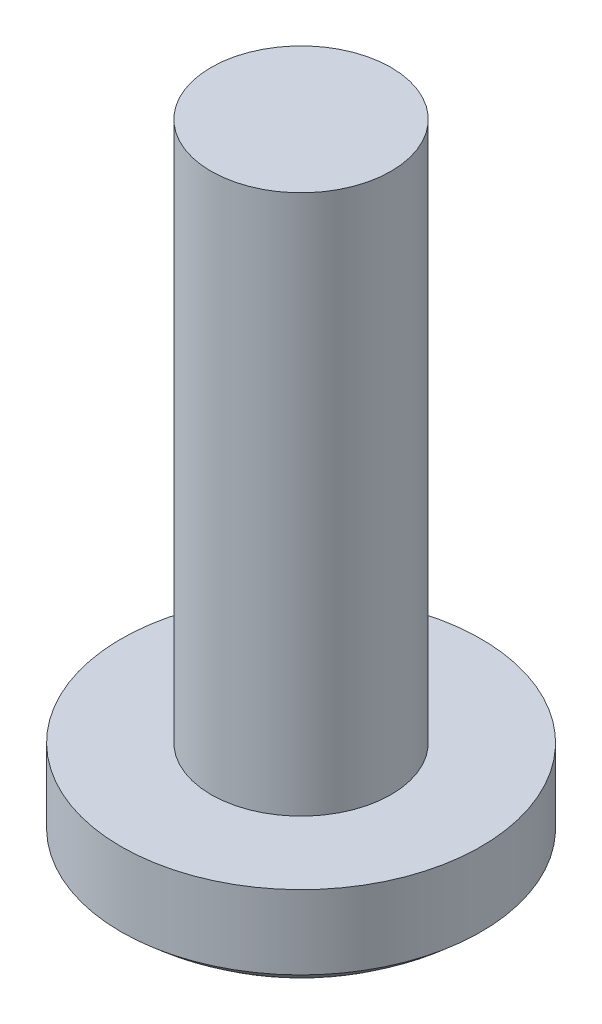
ISO-10303-21;
HEADER;
FILE_DESCRIPTION(('STEP AP214'),'2;1');
FILE_NAME('part.step','',(''),(''),'','','');
FILE_SCHEMA(('AUTOMOTIVE_DESIGN { 1 0 10303 214 1 1 1 1 }'));
ENDSEC;
DATA;
#1=APPLICATION_CONTEXT('core data for automotive mechanical design processes');
#2=APPLICATION_PROTOCOL_DEFINITION('international standard','automotive_design',2000,#1);
#3=PRODUCT_CONTEXT('',#1,'mechanical');
#4=PRODUCT('Part','Part','',(#3));
#5=PRODUCT_RELATED_PRODUCT_CATEGORY('part','',(#4));
#6=PRODUCT_DEFINITION_FORMATION('','',#4);
#7=PRODUCT_DEFINITION_CONTEXT('part definition',#1,'design');
#8=PRODUCT_DEFINITION('design','',#6,#7);
#9=PRODUCT_DEFINITION_SHAPE('','',#8);
#10=(LENGTH_UNIT() NAMED_UNIT(*) SI_UNIT(.MILLI.,.METRE.));
#11=(NAMED_UNIT(*) PLANE_ANGLE_UNIT() SI_UNIT($,.RADIAN.));
#12=(NAMED_UNIT(*) SI_UNIT($,.STERADIAN.) SOLID_ANGLE_UNIT());
#13=UNCERTAINTY_MEASURE_WITH_UNIT(LENGTH_MEASURE(1.E-05),#10,'distance_accuracy_value','');
#14=(GEOMETRIC_REPRESENTATION_CONTEXT(3) GLOBAL_UNCERTAINTY_ASSIGNED_CONTEXT((#13)) GLOBAL_UNIT_ASSIGNED_CONTEXT((#10,
#11,#12)) REPRESENTATION_CONTEXT('',''));
#15=CARTESIAN_POINT('',(0.,0.,0.));
#16=DIRECTION('',(0.,0.,1.));
#17=DIRECTION('',(1.,0.,0.));
#18=AXIS2_PLACEMENT_3D('',#15,#16,#17);
#19=CARTESIAN_POINT('',(0.,2.95659718909581,0.));
#20=DIRECTION('',(0.,1.,0.));
#21=DIRECTION('',(0.,0.,1.));
#22=AXIS2_PLACEMENT_3D('',#19,#20,#21);
#23=SPHERICAL_SURFACE('',#22,2.95659718909581);
#24=CARTESIAN_POINT('',(0.,0.779106215849481,0.));
#25=DIRECTION('',(0.,1.,0.));
#26=DIRECTION('',(0.,0.,1.));
#27=AXIS2_PLACEMENT_3D('',#24,#25,#26);
#28=CIRCLE('',#27,2.);
#29=CARTESIAN_POINT('',(0.,0.779106215849481,2.));
#30=VERTEX_POINT('',#29);
#31=EDGE_CURVE('E155',#30,#30,#28,.T.);
#32=ORIENTED_EDGE('',*,*,#31,.F.);
#33=EDGE_LOOP('',(#32));
#34=FACE_BOUND('',#33,.T.);
#35=CARTESIAN_POINT('',(0.,2.95659718909581,-0.2));
#36=DIRECTION('',(0.,0.,1.));
#37=DIRECTION('',(1.,0.,0.));
#38=AXIS2_PLACEMENT_3D('',#35,#36,#37);
#39=CIRCLE('',#38,2.94982489964561);
#40=CARTESIAN_POINT('',(-0.2,0.0135601627284485,-0.2));
#41=VERTEX_POINT('',#40);
#42=CARTESIAN_POINT('',(-1.,0.181445492598979,-0.2));
#43=VERTEX_POINT('',#42);
#44=EDGE_CURVE('E135',#41,#43,#39,.F.);
#45=ORIENTED_EDGE('',*,*,#44,.T.);
#46=CARTESIAN_POINT('',(-1.,2.95659718909581,0.));
#47=DIRECTION('',(1.,0.,0.));
#48=DIRECTION('',(0.,0.,-1.));
#49=AXIS2_PLACEMENT_3D('',#46,#47,#48);
#50=CIRCLE('',#49,2.78234917624824);
#51=CARTESIAN_POINT('',(-1.,0.181445492598979,0.2));
#52=VERTEX_POINT('',#51);
#53=EDGE_CURVE('E12',#43,#52,#50,.F.);
#54=ORIENTED_EDGE('',*,*,#53,.T.);
#55=CARTESIAN_POINT('',(0.,2.95659718909581,0.2));
#56=DIRECTION('',(0.,0.,-1.));
#57=DIRECTION('',(-1.,0.,0.));
#58=AXIS2_PLACEMENT_3D('',#55,#56,#57);
#59=CIRCLE('',#58,2.94982489964561);
#60=CARTESIAN_POINT('',(-0.2,0.0135601627284485,0.2));
#61=VERTEX_POINT('',#60);
#62=EDGE_CURVE('E50',#52,#61,#59,.F.);
#63=ORIENTED_EDGE('',*,*,#62,.T.);
#64=CARTESIAN_POINT('',(-0.2,2.95659718909581,0.));
#65=DIRECTION('',(1.,0.,0.));
#66=DIRECTION('',(0.,0.,-1.));
#67=AXIS2_PLACEMENT_3D('',#64,#65,#66);
#68=CIRCLE('',#67,2.94982489964561);
#69=CARTESIAN_POINT('',(-0.2,0.181445492598978,1.));
#70=VERTEX_POINT('',#69);
#71=EDGE_CURVE('E281',#61,#70,#68,.F.);
#72=ORIENTED_EDGE('',*,*,#71,.T.);
#73=CARTESIAN_POINT('',(0.,2.95659718909581,1.));
#74=DIRECTION('',(0.,0.,-1.));
#75=DIRECTION('',(-1.,0.,0.));
#76=AXIS2_PLACEMENT_3D('',#73,#74,#75);
#77=CIRCLE('',#76,2.78234917624824);
#78=CARTESIAN_POINT('',(0.2,0.181445492598979,1.));
#79=VERTEX_POINT('',#78);
#80=EDGE_CURVE('E277',#70,#79,#77,.F.);
#81=ORIENTED_EDGE('',*,*,#80,.T.);
#82=CARTESIAN_POINT('',(0.2,2.95659718909581,0.));
#83=DIRECTION('',(-1.,0.,0.));
#84=DIRECTION('',(0.,0.,1.));
#85=AXIS2_PLACEMENT_3D('',#82,#83,#84);
#86=CIRCLE('',#85,2.94982489964561);
#87=CARTESIAN_POINT('',(0.2,0.0135601627284485,0.2));
#88=VERTEX_POINT('',#87);
#89=EDGE_CURVE('E273',#79,#88,#86,.F.);
#90=ORIENTED_EDGE('',*,*,#89,.T.);
#91=CARTESIAN_POINT('',(0.,2.95659718909581,0.2));
#92=DIRECTION('',(0.,0.,-1.));
#93=DIRECTION('',(-1.,0.,0.));
#94=AXIS2_PLACEMENT_3D('',#91,#92,#93);
#95=CIRCLE('',#94,2.94982489964561);
#96=CARTESIAN_POINT('',(1.,0.181445492598978,0.2));
#97=VERTEX_POINT('',#96);
#98=EDGE_CURVE('E269',#88,#97,#95,.F.);
#99=ORIENTED_EDGE('',*,*,#98,.T.);
#100=CARTESIAN_POINT('',(1.,2.95659718909581,0.));
#101=DIRECTION('',(-1.,0.,0.));
#102=DIRECTION('',(0.,0.,1.));
#103=AXIS2_PLACEMENT_3D('',#100,#101,#102);
#104=CIRCLE('',#103,2.78234917624824);
#105=CARTESIAN_POINT('',(1.,0.181445492598979,-0.2));
#106=VERTEX_POINT('',#105);
#107=EDGE_CURVE('E265',#97,#106,#104,.F.);
#108=ORIENTED_EDGE('',*,*,#107,.T.);
#109=CARTESIAN_POINT('',(0.,2.95659718909581,-0.2));
#110=DIRECTION('',(0.,0.,1.));
#111=DIRECTION('',(1.,0.,0.));
#112=AXIS2_PLACEMENT_3D('',#109,#110,#111);
#113=CIRCLE('',#112,2.94982489964561);
#114=CARTESIAN_POINT('',(0.2,0.0135601627284485,-0.2));
#115=VERTEX_POINT('',#114);
#116=EDGE_CURVE('E261',#106,#115,#113,.F.);
#117=ORIENTED_EDGE('',*,*,#116,.T.);
#118=CARTESIAN_POINT('',(0.2,2.95659718909581,0.));
#119=DIRECTION('',(-1.,0.,0.));
#120=DIRECTION('',(0.,0.,1.));
#121=AXIS2_PLACEMENT_3D('',#118,#119,#120);
#122=CIRCLE('',#121,2.94982489964561);
#123=CARTESIAN_POINT('',(0.2,0.181445492598978,-1.));
#124=VERTEX_POINT('',#123);
#125=EDGE_CURVE('E257',#115,#124,#122,.F.);
#126=ORIENTED_EDGE('',*,*,#125,.T.);
#127=CARTESIAN_POINT('',(0.,2.95659718909581,-1.));
#128=DIRECTION('',(0.,0.,1.));
#129=DIRECTION('',(1.,0.,0.));
#130=AXIS2_PLACEMENT_3D('',#127,#128,#129);
#131=CIRCLE('',#130,2.78234917624824);
#132=CARTESIAN_POINT('',(-0.2,0.181445492598979,-1.));
#133=VERTEX_POINT('',#132);
#134=EDGE_CURVE('E253',#124,#133,#131,.F.);
#135=ORIENTED_EDGE('',*,*,#134,.T.);
#136=CARTESIAN_POINT('',(-0.2,2.95659718909581,0.));
#137=DIRECTION('',(1.,0.,0.));
#138=DIRECTION('',(0.,0.,-1.));
#139=AXIS2_PLACEMENT_3D('',#136,#137,#138);
#140=CIRCLE('',#139,2.94982489964561);
#141=EDGE_CURVE('E250',#133,#41,#140,.F.);
#142=ORIENTED_EDGE('',*,*,#141,.T.);
#143=EDGE_LOOP('',(#45,#54,#63,#72,#81,#90,#99,#108,#117,#126,#135,#142));
#144=FACE_BOUND('',#143,.T.);
#145=ADVANCED_FACE('F41',(#34,#144),#23,.T.);
#146=CARTESIAN_POINT('',(0.,1.6,0.));
#147=DIRECTION('',(0.,-1.,0.));
#148=DIRECTION('',(0.,0.,-1.));
#149=AXIS2_PLACEMENT_3D('',#146,#147,#148);
#150=CYLINDRICAL_SURFACE('',#149,2.);
#151=ORIENTED_EDGE('',*,*,#31,.T.);
#152=EDGE_LOOP('',(#151));
#153=FACE_BOUND('',#152,.T.);
#154=CARTESIAN_POINT('',(0.,1.6,0.));
#155=DIRECTION('',(0.,1.,0.));
#156=DIRECTION('',(0.,0.,1.));
#157=AXIS2_PLACEMENT_3D('',#154,#155,#156);
#158=CIRCLE('',#157,2.);
#159=CARTESIAN_POINT('',(0.,1.6,2.));
#160=VERTEX_POINT('',#159);
#161=EDGE_CURVE('E240',#160,#160,#158,.T.);
#162=ORIENTED_EDGE('',*,*,#161,.F.);
#163=EDGE_LOOP('',(#162));
#164=FACE_BOUND('',#163,.T.);
#165=ADVANCED_FACE('F43',(#153,#164),#150,.T.);
#166=CARTESIAN_POINT('',(0.,1.6,0.));
#167=DIRECTION('',(0.,1.,0.));
#168=DIRECTION('',(0.,0.,1.));
#169=AXIS2_PLACEMENT_3D('',#166,#167,#168);
#170=PLANE('',#169);
#171=CARTESIAN_POINT('',(0.,1.6,0.));
#172=DIRECTION('',(0.,1.,0.));
#173=DIRECTION('',(0.,0.,1.));
#174=AXIS2_PLACEMENT_3D('',#171,#172,#173);
#175=CIRCLE('',#174,1.);
#176=CARTESIAN_POINT('',(0.,1.6,1.));
#177=VERTEX_POINT('',#176);
#178=EDGE_CURVE('E241',#177,#177,#175,.T.);
#179=ORIENTED_EDGE('',*,*,#178,.F.);
#180=EDGE_LOOP('',(#179));
#181=FACE_BOUND('',#180,.T.);
#182=ORIENTED_EDGE('',*,*,#161,.T.);
#183=EDGE_LOOP('',(#182));
#184=FACE_BOUND('',#183,.T.);
#185=ADVANCED_FACE('F327',(#181,#184),#170,.T.);
#186=CARTESIAN_POINT('',(0.,7.6,0.));
#187=DIRECTION('',(0.,-1.,0.));
#188=DIRECTION('',(0.,0.,-1.));
#189=AXIS2_PLACEMENT_3D('',#186,#187,#188);
#190=CYLINDRICAL_SURFACE('',#189,1.);
#191=CARTESIAN_POINT('',(0.,7.6,0.));
#192=DIRECTION('',(0.,1.,0.));
#193=DIRECTION('',(0.,0.,1.));
#194=AXIS2_PLACEMENT_3D('',#191,#192,#193);
#195=CIRCLE('',#194,1.);
#196=CARTESIAN_POINT('',(0.,7.6,1.));
#197=VERTEX_POINT('',#196);
#198=EDGE_CURVE('E161',#197,#197,#195,.T.);
#199=ORIENTED_EDGE('',*,*,#198,.F.);
#200=EDGE_LOOP('',(#199));
#201=FACE_BOUND('',#200,.T.);
#202=ORIENTED_EDGE('',*,*,#178,.T.);
#203=EDGE_LOOP('',(#202));
#204=FACE_BOUND('',#203,.T.);
#205=ADVANCED_FACE('F336',(#201,#204),#190,.T.);
#206=CARTESIAN_POINT('',(0.,7.6,0.));
#207=DIRECTION('',(0.,1.,0.));
#208=DIRECTION('',(0.,0.,1.));
#209=AXIS2_PLACEMENT_3D('',#206,#207,#208);
#210=PLANE('',#209);
#211=ORIENTED_EDGE('',*,*,#198,.T.);
#212=EDGE_LOOP('',(#211));
#213=FACE_BOUND('',#212,.T.);
#214=ADVANCED_FACE('F333',(#213),#210,.T.);
#215=CARTESIAN_POINT('',(-1.,4.42842712474619,0.2));
#216=DIRECTION('',(1.,0.,0.));
#217=DIRECTION('',(0.,0.,-1.));
#218=AXIS2_PLACEMENT_3D('',#215,#216,#217);
#219=PLANE('',#218);
#220=DIRECTION('',(0.,-1.,0.));
#221=VECTOR('',#220,1.);
#222=CARTESIAN_POINT('',(-1.,4.42842712474619,-0.2));
#223=LINE('',#222,#221);
#224=CARTESIAN_POINT('',(-1.,1.,-0.2));
#225=VERTEX_POINT('',#224);
#226=EDGE_CURVE('E57',#225,#43,#223,.T.);
#227=ORIENTED_EDGE('',*,*,#226,.F.);
#228=DIRECTION('',(0.,0.,1.));
#229=VECTOR('',#228,1.);
#230=CARTESIAN_POINT('',(-1.,1.,0.2));
#231=LINE('',#230,#229);
#232=CARTESIAN_POINT('',(-1.,1.,0.2));
#233=VERTEX_POINT('',#232);
#234=EDGE_CURVE('E148',#225,#233,#231,.T.);
#235=ORIENTED_EDGE('',*,*,#234,.T.);
#236=DIRECTION('',(0.,-1.,0.));
#237=VECTOR('',#236,1.);
#238=CARTESIAN_POINT('',(-1.,4.42842712474619,0.2));
#239=LINE('',#238,#237);
#240=EDGE_CURVE('E199',#233,#52,#239,.T.);
#241=ORIENTED_EDGE('',*,*,#240,.T.);
#242=ORIENTED_EDGE('',*,*,#53,.F.);
#243=EDGE_LOOP('',(#227,#235,#241,#242));
#244=FACE_BOUND('',#243,.T.);
#245=ADVANCED_FACE('F287',(#244),#219,.T.);
#246=CARTESIAN_POINT('',(-1.,4.42842712474619,0.2));
#247=DIRECTION('',(0.,0.,-1.));
#248=DIRECTION('',(-1.,0.,0.));
#249=AXIS2_PLACEMENT_3D('',#246,#247,#248);
#250=PLANE('',#249);
#251=ORIENTED_EDGE('',*,*,#240,.F.);
#252=DIRECTION('',(1.,0.,0.));
#253=VECTOR('',#252,1.);
#254=CARTESIAN_POINT('',(-1.,1.,0.2));
#255=LINE('',#254,#253);
#256=CARTESIAN_POINT('',(-0.2,1.,0.2));
#257=VERTEX_POINT('',#256);
#258=EDGE_CURVE('E193',#233,#257,#255,.T.);
#259=ORIENTED_EDGE('',*,*,#258,.T.);
#260=DIRECTION('',(0.,-1.,0.));
#261=VECTOR('',#260,1.);
#262=CARTESIAN_POINT('',(-0.2,4.42842712474619,0.2));
#263=LINE('',#262,#261);
#264=EDGE_CURVE('E202',#257,#61,#263,.T.);
#265=ORIENTED_EDGE('',*,*,#264,.T.);
#266=ORIENTED_EDGE('',*,*,#62,.F.);
#267=EDGE_LOOP('',(#251,#259,#265,#266));
#268=FACE_BOUND('',#267,.T.);
#269=ADVANCED_FACE('F288',(#268),#250,.T.);
#270=CARTESIAN_POINT('',(-0.2,4.42842712474619,1.));
#271=DIRECTION('',(1.,0.,0.));
#272=DIRECTION('',(0.,0.,-1.));
#273=AXIS2_PLACEMENT_3D('',#270,#271,#272);
#274=PLANE('',#273);
#275=ORIENTED_EDGE('',*,*,#264,.F.);
#276=DIRECTION('',(0.,0.,1.));
#277=VECTOR('',#276,1.);
#278=CARTESIAN_POINT('',(-0.2,1.,1.));
#279=LINE('',#278,#277);
#280=CARTESIAN_POINT('',(-0.2,1.,1.));
#281=VERTEX_POINT('',#280);
#282=EDGE_CURVE('E189',#257,#281,#279,.T.);
#283=ORIENTED_EDGE('',*,*,#282,.T.);
#284=DIRECTION('',(0.,-1.,0.));
#285=VECTOR('',#284,1.);
#286=CARTESIAN_POINT('',(-0.2,4.42842712474619,1.));
#287=LINE('',#286,#285);
#288=EDGE_CURVE('E205',#281,#70,#287,.T.);
#289=ORIENTED_EDGE('',*,*,#288,.T.);
#290=ORIENTED_EDGE('',*,*,#71,.F.);
#291=EDGE_LOOP('',(#275,#283,#289,#290));
#292=FACE_BOUND('',#291,.T.);
#293=ADVANCED_FACE('F292',(#292),#274,.T.);
#294=CARTESIAN_POINT('',(0.2,4.42842712474619,1.));
#295=DIRECTION('',(0.,0.,-1.));
#296=DIRECTION('',(-1.,0.,0.));
#297=AXIS2_PLACEMENT_3D('',#294,#295,#296);
#298=PLANE('',#297);
#299=ORIENTED_EDGE('',*,*,#288,.F.);
#300=DIRECTION('',(1.,0.,0.));
#301=VECTOR('',#300,1.);
#302=CARTESIAN_POINT('',(0.2,1.,1.));
#303=LINE('',#302,#301);
#304=CARTESIAN_POINT('',(0.2,1.,1.));
#305=VERTEX_POINT('',#304);
#306=EDGE_CURVE('E185',#281,#305,#303,.T.);
#307=ORIENTED_EDGE('',*,*,#306,.T.);
#308=DIRECTION('',(0.,-1.,0.));
#309=VECTOR('',#308,1.);
#310=CARTESIAN_POINT('',(0.2,4.42842712474619,1.));
#311=LINE('',#310,#309);
#312=EDGE_CURVE('E209',#305,#79,#311,.T.);
#313=ORIENTED_EDGE('',*,*,#312,.T.);
#314=ORIENTED_EDGE('',*,*,#80,.F.);
#315=EDGE_LOOP('',(#299,#307,#313,#314));
#316=FACE_BOUND('',#315,.T.);
#317=ADVANCED_FACE('F294',(#316),#298,.T.);
#318=CARTESIAN_POINT('',(0.2,4.42842712474619,1.));
#319=DIRECTION('',(-1.,0.,0.));
#320=DIRECTION('',(0.,0.,1.));
#321=AXIS2_PLACEMENT_3D('',#318,#319,#320);
#322=PLANE('',#321);
#323=ORIENTED_EDGE('',*,*,#312,.F.);
#324=DIRECTION('',(0.,0.,-1.));
#325=VECTOR('',#324,1.);
#326=CARTESIAN_POINT('',(0.2,1.,1.));
#327=LINE('',#326,#325);
#328=CARTESIAN_POINT('',(0.2,1.,0.2));
#329=VERTEX_POINT('',#328);
#330=EDGE_CURVE('E181',#305,#329,#327,.T.);
#331=ORIENTED_EDGE('',*,*,#330,.T.);
#332=DIRECTION('',(0.,-1.,0.));
#333=VECTOR('',#332,1.);
#334=CARTESIAN_POINT('',(0.2,4.42842712474619,0.2));
#335=LINE('',#334,#333);
#336=EDGE_CURVE('E213',#329,#88,#335,.T.);
#337=ORIENTED_EDGE('',*,*,#336,.T.);
#338=ORIENTED_EDGE('',*,*,#89,.F.);
#339=EDGE_LOOP('',(#323,#331,#337,#338));
#340=FACE_BOUND('',#339,.T.);
#341=ADVANCED_FACE('F297',(#340),#322,.T.);
#342=CARTESIAN_POINT('',(0.2,4.42842712474619,0.2));
#343=DIRECTION('',(0.,0.,-1.));
#344=DIRECTION('',(-1.,0.,0.));
#345=AXIS2_PLACEMENT_3D('',#342,#343,#344);
#346=PLANE('',#345);
#347=ORIENTED_EDGE('',*,*,#336,.F.);
#348=DIRECTION('',(1.,0.,0.));
#349=VECTOR('',#348,1.);
#350=CARTESIAN_POINT('',(0.2,1.,0.2));
#351=LINE('',#350,#349);
#352=CARTESIAN_POINT('',(1.,1.,0.2));
#353=VERTEX_POINT('',#352);
#354=EDGE_CURVE('E177',#329,#353,#351,.T.);
#355=ORIENTED_EDGE('',*,*,#354,.T.);
#356=DIRECTION('',(0.,-1.,0.));
#357=VECTOR('',#356,1.);
#358=CARTESIAN_POINT('',(1.,4.42842712474619,0.2));
#359=LINE('',#358,#357);
#360=EDGE_CURVE('E217',#353,#97,#359,.T.);
#361=ORIENTED_EDGE('',*,*,#360,.T.);
#362=ORIENTED_EDGE('',*,*,#98,.F.);
#363=EDGE_LOOP('',(#347,#355,#361,#362));
#364=FACE_BOUND('',#363,.T.);
#365=ADVANCED_FACE('F300',(#364),#346,.T.);
#366=CARTESIAN_POINT('',(1.,4.42842712474619,0.2));
#367=DIRECTION('',(-1.,0.,0.));
#368=DIRECTION('',(0.,0.,1.));
#369=AXIS2_PLACEMENT_3D('',#366,#367,#368);
#370=PLANE('',#369);
#371=ORIENTED_EDGE('',*,*,#360,.F.);
#372=DIRECTION('',(0.,0.,-1.));
#373=VECTOR('',#372,1.);
#374=CARTESIAN_POINT('',(1.,1.,0.2));
#375=LINE('',#374,#373);
#376=CARTESIAN_POINT('',(1.,1.,-0.2));
#377=VERTEX_POINT('',#376);
#378=EDGE_CURVE('E173',#353,#377,#375,.T.);
#379=ORIENTED_EDGE('',*,*,#378,.T.);
#380=DIRECTION('',(0.,-1.,0.));
#381=VECTOR('',#380,1.);
#382=CARTESIAN_POINT('',(1.,4.42842712474619,-0.2));
#383=LINE('',#382,#381);
#384=EDGE_CURVE('E221',#377,#106,#383,.T.);
#385=ORIENTED_EDGE('',*,*,#384,.T.);
#386=ORIENTED_EDGE('',*,*,#107,.F.);
#387=EDGE_LOOP('',(#371,#379,#385,#386));
#388=FACE_BOUND('',#387,.T.);
#389=ADVANCED_FACE('F303',(#388),#370,.T.);
#390=CARTESIAN_POINT('',(0.2,4.42842712474619,-0.2));
#391=DIRECTION('',(0.,0.,1.));
#392=DIRECTION('',(1.,0.,0.));
#393=AXIS2_PLACEMENT_3D('',#390,#391,#392);
#394=PLANE('',#393);
#395=ORIENTED_EDGE('',*,*,#384,.F.);
#396=DIRECTION('',(-1.,0.,0.));
#397=VECTOR('',#396,1.);
#398=CARTESIAN_POINT('',(0.2,1.,-0.2));
#399=LINE('',#398,#397);
#400=CARTESIAN_POINT('',(0.2,1.,-0.2));
#401=VERTEX_POINT('',#400);
#402=EDGE_CURVE('E169',#377,#401,#399,.T.);
#403=ORIENTED_EDGE('',*,*,#402,.T.);
#404=DIRECTION('',(0.,-1.,0.));
#405=VECTOR('',#404,1.);
#406=CARTESIAN_POINT('',(0.2,4.42842712474619,-0.2));
#407=LINE('',#406,#405);
#408=EDGE_CURVE('E225',#401,#115,#407,.T.);
#409=ORIENTED_EDGE('',*,*,#408,.T.);
#410=ORIENTED_EDGE('',*,*,#116,.F.);
#411=EDGE_LOOP('',(#395,#403,#409,#410));
#412=FACE_BOUND('',#411,.T.);
#413=ADVANCED_FACE('F306',(#412),#394,.T.);
#414=CARTESIAN_POINT('',(0.2,4.42842712474619,-0.2));
#415=DIRECTION('',(-1.,0.,0.));
#416=DIRECTION('',(0.,0.,1.));
#417=AXIS2_PLACEMENT_3D('',#414,#415,#416);
#418=PLANE('',#417);
#419=ORIENTED_EDGE('',*,*,#408,.F.);
#420=DIRECTION('',(0.,0.,-1.));
#421=VECTOR('',#420,1.);
#422=CARTESIAN_POINT('',(0.2,1.,-0.2));
#423=LINE('',#422,#421);
#424=CARTESIAN_POINT('',(0.2,1.,-1.));
#425=VERTEX_POINT('',#424);
#426=EDGE_CURVE('E163',#401,#425,#423,.T.);
#427=ORIENTED_EDGE('',*,*,#426,.T.);
#428=DIRECTION('',(0.,-1.,0.));
#429=VECTOR('',#428,1.);
#430=CARTESIAN_POINT('',(0.2,4.42842712474619,-1.));
#431=LINE('',#430,#429);
#432=EDGE_CURVE('E229',#425,#124,#431,.T.);
#433=ORIENTED_EDGE('',*,*,#432,.T.);
#434=ORIENTED_EDGE('',*,*,#125,.F.);
#435=EDGE_LOOP('',(#419,#427,#433,#434));
#436=FACE_BOUND('',#435,.T.);
#437=ADVANCED_FACE('F309',(#436),#418,.T.);
#438=CARTESIAN_POINT('',(0.2,4.42842712474619,-1.));
#439=DIRECTION('',(0.,0.,1.));
#440=DIRECTION('',(1.,0.,0.));
#441=AXIS2_PLACEMENT_3D('',#438,#439,#440);
#442=PLANE('',#441);
#443=ORIENTED_EDGE('',*,*,#432,.F.);
#444=DIRECTION('',(-1.,0.,0.));
#445=VECTOR('',#444,1.);
#446=CARTESIAN_POINT('',(0.2,1.,-1.));
#447=LINE('',#446,#445);
#448=CARTESIAN_POINT('',(-0.2,1.,-1.));
#449=VERTEX_POINT('',#448);
#450=EDGE_CURVE('E156',#425,#449,#447,.T.);
#451=ORIENTED_EDGE('',*,*,#450,.T.);
#452=DIRECTION('',(0.,-1.,0.));
#453=VECTOR('',#452,1.);
#454=CARTESIAN_POINT('',(-0.2,4.42842712474619,-1.));
#455=LINE('',#454,#453);
#456=EDGE_CURVE('E140',#449,#133,#455,.T.);
#457=ORIENTED_EDGE('',*,*,#456,.T.);
#458=ORIENTED_EDGE('',*,*,#134,.F.);
#459=EDGE_LOOP('',(#443,#451,#457,#458));
#460=FACE_BOUND('',#459,.T.);
#461=ADVANCED_FACE('F312',(#460),#442,.T.);
#462=CARTESIAN_POINT('',(-0.2,4.42842712474619,-0.2));
#463=DIRECTION('',(1.,0.,0.));
#464=DIRECTION('',(0.,0.,-1.));
#465=AXIS2_PLACEMENT_3D('',#462,#463,#464);
#466=PLANE('',#465);
#467=ORIENTED_EDGE('',*,*,#456,.F.);
#468=DIRECTION('',(0.,0.,1.));
#469=VECTOR('',#468,1.);
#470=CARTESIAN_POINT('',(-0.2,1.,-0.2));
#471=LINE('',#470,#469);
#472=CARTESIAN_POINT('',(-0.2,1.,-0.2));
#473=VERTEX_POINT('',#472);
#474=EDGE_CURVE('E145',#449,#473,#471,.T.);
#475=ORIENTED_EDGE('',*,*,#474,.T.);
#476=DIRECTION('',(0.,-1.,0.));
#477=VECTOR('',#476,1.);
#478=CARTESIAN_POINT('',(-0.2,4.42842712474619,-0.2));
#479=LINE('',#478,#477);
#480=EDGE_CURVE('E130',#473,#41,#479,.T.);
#481=ORIENTED_EDGE('',*,*,#480,.T.);
#482=ORIENTED_EDGE('',*,*,#141,.F.);
#483=EDGE_LOOP('',(#467,#475,#481,#482));
#484=FACE_BOUND('',#483,.T.);
#485=ADVANCED_FACE('F151',(#484),#466,.T.);
#486=CARTESIAN_POINT('',(-1.,4.42842712474619,-0.2));
#487=DIRECTION('',(0.,0.,1.));
#488=DIRECTION('',(1.,0.,0.));
#489=AXIS2_PLACEMENT_3D('',#486,#487,#488);
#490=PLANE('',#489);
#491=ORIENTED_EDGE('',*,*,#480,.F.);
#492=DIRECTION('',(-1.,0.,0.));
#493=VECTOR('',#492,1.);
#494=CARTESIAN_POINT('',(-1.,1.,-0.2));
#495=LINE('',#494,#493);
#496=EDGE_CURVE('E133',#473,#225,#495,.T.);
#497=ORIENTED_EDGE('',*,*,#496,.T.);
#498=ORIENTED_EDGE('',*,*,#226,.T.);
#499=ORIENTED_EDGE('',*,*,#44,.F.);
#500=EDGE_LOOP('',(#491,#497,#498,#499));
#501=FACE_BOUND('',#500,.T.);
#502=ADVANCED_FACE('F132',(#501),#490,.T.);
#503=CARTESIAN_POINT('',(0.,1.,0.));
#504=DIRECTION('',(0.,1.,0.));
#505=DIRECTION('',(0.,0.,1.));
#506=AXIS2_PLACEMENT_3D('',#503,#504,#505);
#507=PLANE('',#506);
#508=ORIENTED_EDGE('',*,*,#496,.F.);
#509=ORIENTED_EDGE('',*,*,#474,.F.);
#510=ORIENTED_EDGE('',*,*,#450,.F.);
#511=ORIENTED_EDGE('',*,*,#426,.F.);
#512=ORIENTED_EDGE('',*,*,#402,.F.);
#513=ORIENTED_EDGE('',*,*,#378,.F.);
#514=ORIENTED_EDGE('',*,*,#354,.F.);
#515=ORIENTED_EDGE('',*,*,#330,.F.);
#516=ORIENTED_EDGE('',*,*,#306,.F.);
#517=ORIENTED_EDGE('',*,*,#282,.F.);
#518=ORIENTED_EDGE('',*,*,#258,.F.);
#519=ORIENTED_EDGE('',*,*,#234,.F.);
#520=EDGE_LOOP('',(#508,#509,#510,#511,#512,#513,#514,#515,#516,#517,#518,#519));
#521=FACE_BOUND('',#520,.T.);
#522=ADVANCED_FACE('F144',(#521),#507,.F.);
#523=CLOSED_SHELL('',(#145,#165,#185,#205,#214,#245,#269,#293,#317,#341,#365,#389,#413,#437,
#461,#485,#502,#522));
#524=MANIFOLD_SOLID_BREP('B2',#523);
#525=ADVANCED_BREP_SHAPE_REPRESENTATION('',(#18,#524),#14);
#526=SHAPE_DEFINITION_REPRESENTATION(#9,#525);
ENDSEC;
END-ISO-10303-21;
